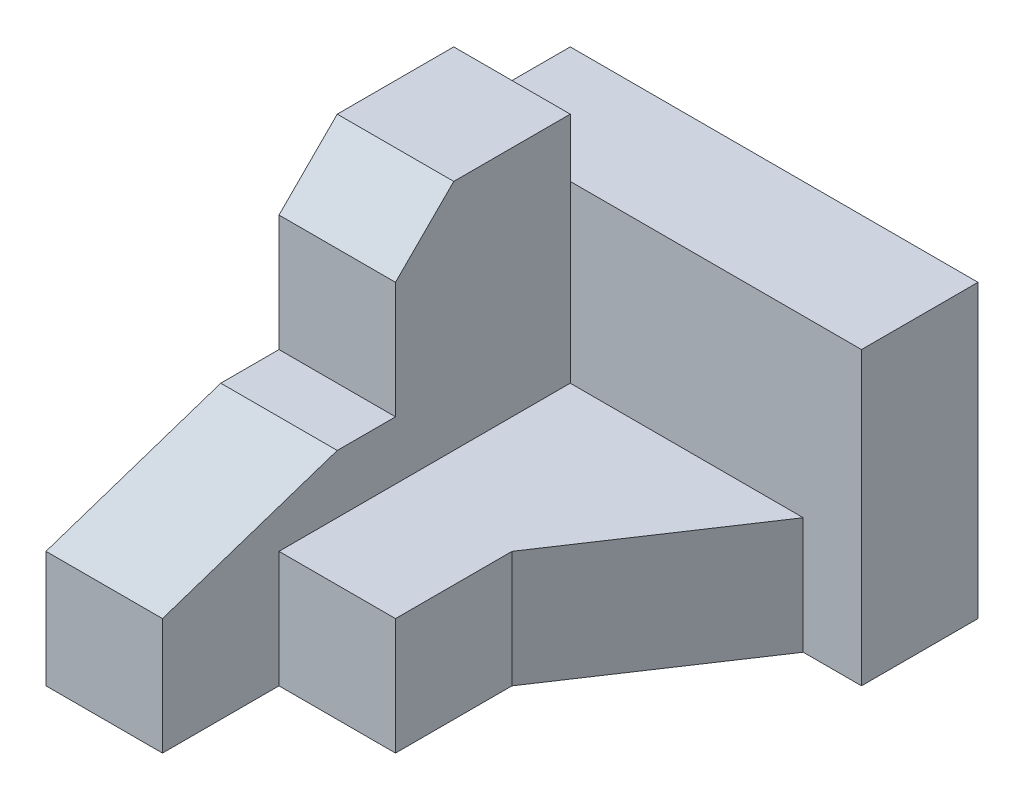
ISO-10303-21;
HEADER;
FILE_DESCRIPTION(('STEP AP214'),'2;1');
FILE_NAME('part.step','',(''),(''),'','','');
FILE_SCHEMA(('AUTOMOTIVE_DESIGN { 1 0 10303 214 1 1 1 1 }'));
ENDSEC;
DATA;
#1=APPLICATION_CONTEXT('core data for automotive mechanical design processes');
#2=APPLICATION_PROTOCOL_DEFINITION('international standard','automotive_design',2000,#1);
#3=PRODUCT_CONTEXT('',#1,'mechanical');
#4=PRODUCT('Part','Part','',(#3));
#5=PRODUCT_RELATED_PRODUCT_CATEGORY('part','',(#4));
#6=PRODUCT_DEFINITION_FORMATION('','',#4);
#7=PRODUCT_DEFINITION_CONTEXT('part definition',#1,'design');
#8=PRODUCT_DEFINITION('design','',#6,#7);
#9=PRODUCT_DEFINITION_SHAPE('','',#8);
#10=(LENGTH_UNIT() NAMED_UNIT(*) SI_UNIT(.MILLI.,.METRE.));
#11=(NAMED_UNIT(*) PLANE_ANGLE_UNIT() SI_UNIT($,.RADIAN.));
#12=(NAMED_UNIT(*) SI_UNIT($,.STERADIAN.) SOLID_ANGLE_UNIT());
#13=UNCERTAINTY_MEASURE_WITH_UNIT(LENGTH_MEASURE(1.E-05),#10,'distance_accuracy_value','');
#14=(GEOMETRIC_REPRESENTATION_CONTEXT(3) GLOBAL_UNCERTAINTY_ASSIGNED_CONTEXT((#13)) GLOBAL_UNIT_ASSIGNED_CONTEXT((#10,
#11,#12)) REPRESENTATION_CONTEXT('',''));
#15=CARTESIAN_POINT('',(0.,0.,0.));
#16=DIRECTION('',(0.,0.,1.));
#17=DIRECTION('',(1.,0.,0.));
#18=AXIS2_PLACEMENT_3D('',#15,#16,#17);
#19=CARTESIAN_POINT('',(0.,2.,-9.));
#20=DIRECTION('',(1.,0.,0.));
#21=DIRECTION('',(0.,0.,-1.));
#22=AXIS2_PLACEMENT_3D('',#19,#20,#21);
#23=PLANE('',#22);
#24=DIRECTION('',(0.,-0.316227766016838,0.948683298050514));
#25=VECTOR('',#24,1.);
#26=CARTESIAN_POINT('',(0.,4.7,-8.1));
#27=LINE('',#26,#25);
#28=CARTESIAN_POINT('',(-2.5E-06,3.,-3.));
#29=VERTEX_POINT('',#28);
#30=CARTESIAN_POINT('',(0.,2.,0.));
#31=VERTEX_POINT('',#30);
#32=EDGE_CURVE('E157',#29,#31,#27,.T.);
#33=ORIENTED_EDGE('',*,*,#32,.F.);
#34=DIRECTION('',(0.,0.,1.));
#35=VECTOR('',#34,1.);
#36=CARTESIAN_POINT('',(0.,3.,-9.));
#37=LINE('',#36,#35);
#38=CARTESIAN_POINT('',(0.,3.,-4.));
#39=VERTEX_POINT('',#38);
#40=EDGE_CURVE('E301',#39,#29,#37,.T.);
#41=ORIENTED_EDGE('',*,*,#40,.F.);
#42=DIRECTION('',(0.,-1.,0.));
#43=VECTOR('',#42,1.);
#44=CARTESIAN_POINT('',(0.,2.,-4.));
#45=LINE('',#44,#43);
#46=CARTESIAN_POINT('',(-2.50000000000684E-05,5.,-4.));
#47=VERTEX_POINT('',#46);
#48=EDGE_CURVE('E310',#47,#39,#45,.T.);
#49=ORIENTED_EDGE('',*,*,#48,.F.);
#50=DIRECTION('',(0.,-0.707106781186548,0.707106781186548));
#51=VECTOR('',#50,1.);
#52=CARTESIAN_POINT('',(0.,6.,-5.));
#53=LINE('',#52,#51);
#54=CARTESIAN_POINT('',(0.,6.,-5.));
#55=VERTEX_POINT('',#54);
#56=EDGE_CURVE('E300',#55,#47,#53,.T.);
#57=ORIENTED_EDGE('',*,*,#56,.F.);
#58=DIRECTION('',(0.,0.,1.));
#59=VECTOR('',#58,1.);
#60=CARTESIAN_POINT('',(0.,6.,-7.));
#61=LINE('',#60,#59);
#62=CARTESIAN_POINT('',(0.,6.,-7.));
#63=VERTEX_POINT('',#62);
#64=EDGE_CURVE('E321',#63,#55,#61,.T.);
#65=ORIENTED_EDGE('',*,*,#64,.F.);
#66=DIRECTION('',(0.,-1.,0.));
#67=VECTOR('',#66,1.);
#68=CARTESIAN_POINT('',(0.,6.,-7.));
#69=LINE('',#68,#67);
#70=CARTESIAN_POINT('',(0.,5.,-7.));
#71=VERTEX_POINT('',#70);
#72=EDGE_CURVE('E289',#63,#71,#69,.T.);
#73=ORIENTED_EDGE('',*,*,#72,.T.);
#74=DIRECTION('',(0.,0.,1.));
#75=VECTOR('',#74,1.);
#76=CARTESIAN_POINT('',(0.,5.,-9.));
#77=LINE('',#76,#75);
#78=CARTESIAN_POINT('',(0.,5.,-9.));
#79=VERTEX_POINT('',#78);
#80=EDGE_CURVE('E240',#79,#71,#77,.T.);
#81=ORIENTED_EDGE('',*,*,#80,.F.);
#82=DIRECTION('',(0.,-1.,0.));
#83=VECTOR('',#82,1.);
#84=CARTESIAN_POINT('',(0.,2.,-9.));
#85=LINE('',#84,#83);
#86=CARTESIAN_POINT('',(0.,0.,-9.));
#87=VERTEX_POINT('',#86);
#88=EDGE_CURVE('E217',#79,#87,#85,.T.);
#89=ORIENTED_EDGE('',*,*,#88,.T.);
#90=DIRECTION('',(0.,0.,1.));
#91=VECTOR('',#90,1.);
#92=CARTESIAN_POINT('',(0.,0.,-9.));
#93=LINE('',#92,#91);
#94=CARTESIAN_POINT('',(0.,0.,0.));
#95=VERTEX_POINT('',#94);
#96=EDGE_CURVE('E200',#87,#95,#93,.T.);
#97=ORIENTED_EDGE('',*,*,#96,.T.);
#98=DIRECTION('',(0.,-1.,0.));
#99=VECTOR('',#98,1.);
#100=CARTESIAN_POINT('',(0.,2.,0.));
#101=LINE('',#100,#99);
#102=EDGE_CURVE('E174',#31,#95,#101,.T.);
#103=ORIENTED_EDGE('',*,*,#102,.F.);
#104=EDGE_LOOP('',(#33,#41,#49,#57,#65,#73,#81,#89,#97,#103));
#105=FACE_BOUND('',#104,.T.);
#106=ADVANCED_FACE('F33',(#105),#23,.F.);
#107=CARTESIAN_POINT('',(2.,2.,0.));
#108=DIRECTION('',(-1.,0.,0.));
#109=DIRECTION('',(0.,0.,1.));
#110=AXIS2_PLACEMENT_3D('',#107,#108,#109);
#111=PLANE('',#110);
#112=DIRECTION('',(0.,-0.316227766016838,0.948683298050514));
#113=VECTOR('',#112,1.);
#114=CARTESIAN_POINT('',(2.,1.8,0.6));
#115=LINE('',#114,#113);
#116=CARTESIAN_POINT('',(2.,3.,-3.));
#117=VERTEX_POINT('',#116);
#118=CARTESIAN_POINT('',(2.,2.,0.));
#119=VERTEX_POINT('',#118);
#120=EDGE_CURVE('E154',#117,#119,#115,.T.);
#121=ORIENTED_EDGE('',*,*,#120,.T.);
#122=DIRECTION('',(0.,-1.,0.));
#123=VECTOR('',#122,1.);
#124=CARTESIAN_POINT('',(2.,2.,0.));
#125=LINE('',#124,#123);
#126=CARTESIAN_POINT('',(2.,0.,0.));
#127=VERTEX_POINT('',#126);
#128=EDGE_CURVE('E163',#119,#127,#125,.T.);
#129=ORIENTED_EDGE('',*,*,#128,.T.);
#130=DIRECTION('',(0.,0.,-1.));
#131=VECTOR('',#130,1.);
#132=CARTESIAN_POINT('',(2.,0.,0.));
#133=LINE('',#132,#131);
#134=CARTESIAN_POINT('',(2.,0.,-2.));
#135=VERTEX_POINT('',#134);
#136=EDGE_CURVE('E204',#127,#135,#133,.T.);
#137=ORIENTED_EDGE('',*,*,#136,.T.);
#138=DIRECTION('',(0.,-1.,0.));
#139=VECTOR('',#138,1.);
#140=CARTESIAN_POINT('',(2.,2.,-2.));
#141=LINE('',#140,#139);
#142=CARTESIAN_POINT('',(2.,2.,-2.));
#143=VERTEX_POINT('',#142);
#144=EDGE_CURVE('E175',#143,#135,#141,.T.);
#145=ORIENTED_EDGE('',*,*,#144,.F.);
#146=DIRECTION('',(0.,0.,-1.));
#147=VECTOR('',#146,1.);
#148=CARTESIAN_POINT('',(2.,2.,0.));
#149=LINE('',#148,#147);
#150=CARTESIAN_POINT('',(2.,2.,-7.));
#151=VERTEX_POINT('',#150);
#152=EDGE_CURVE('E101',#143,#151,#149,.T.);
#153=ORIENTED_EDGE('',*,*,#152,.T.);
#154=DIRECTION('',(0.,-1.,0.));
#155=VECTOR('',#154,1.);
#156=CARTESIAN_POINT('',(2.,5.,-7.));
#157=LINE('',#156,#155);
#158=CARTESIAN_POINT('',(2.,5.,-7.));
#159=VERTEX_POINT('',#158);
#160=EDGE_CURVE('E195',#159,#151,#157,.T.);
#161=ORIENTED_EDGE('',*,*,#160,.F.);
#162=DIRECTION('',(0.,-1.,0.));
#163=VECTOR('',#162,1.);
#164=CARTESIAN_POINT('',(2.,6.,-7.));
#165=LINE('',#164,#163);
#166=CARTESIAN_POINT('',(2.,6.,-7.));
#167=VERTEX_POINT('',#166);
#168=EDGE_CURVE('E194',#167,#159,#165,.T.);
#169=ORIENTED_EDGE('',*,*,#168,.F.);
#170=DIRECTION('',(0.,0.,-1.));
#171=VECTOR('',#170,1.);
#172=CARTESIAN_POINT('',(2.,6.,-7.));
#173=LINE('',#172,#171);
#174=CARTESIAN_POINT('',(2.,6.,-5.));
#175=VERTEX_POINT('',#174);
#176=EDGE_CURVE('E296',#175,#167,#173,.T.);
#177=ORIENTED_EDGE('',*,*,#176,.F.);
#178=DIRECTION('',(0.,-0.707106781186548,0.707106781186548));
#179=VECTOR('',#178,1.);
#180=CARTESIAN_POINT('',(2.,0.5,0.5));
#181=LINE('',#180,#179);
#182=CARTESIAN_POINT('',(2.,5.,-4.));
#183=VERTEX_POINT('',#182);
#184=EDGE_CURVE('E49',#175,#183,#181,.T.);
#185=ORIENTED_EDGE('',*,*,#184,.T.);
#186=DIRECTION('',(0.,-1.,0.));
#187=VECTOR('',#186,1.);
#188=CARTESIAN_POINT('',(2.,0.,-4.));
#189=LINE('',#188,#187);
#190=CARTESIAN_POINT('',(2.,3.,-4.));
#191=VERTEX_POINT('',#190);
#192=EDGE_CURVE('E345',#183,#191,#189,.T.);
#193=ORIENTED_EDGE('',*,*,#192,.T.);
#194=DIRECTION('',(0.,0.,1.));
#195=VECTOR('',#194,1.);
#196=CARTESIAN_POINT('',(2.,3.,0.));
#197=LINE('',#196,#195);
#198=EDGE_CURVE('E167',#191,#117,#197,.T.);
#199=ORIENTED_EDGE('',*,*,#198,.T.);
#200=EDGE_LOOP('',(#121,#129,#137,#145,#153,#161,#169,#177,#185,#193,#199));
#201=FACE_BOUND('',#200,.T.);
#202=ADVANCED_FACE('F162',(#201),#111,.F.);
#203=CARTESIAN_POINT('',(0.,2.,0.));
#204=DIRECTION('',(0.,0.,-1.));
#205=DIRECTION('',(-1.,0.,0.));
#206=AXIS2_PLACEMENT_3D('',#203,#204,#205);
#207=PLANE('',#206);
#208=DIRECTION('',(1.,0.,0.));
#209=VECTOR('',#208,1.);
#210=CARTESIAN_POINT('',(0.,2.,0.));
#211=LINE('',#210,#209);
#212=EDGE_CURVE('E11',#31,#119,#211,.T.);
#213=ORIENTED_EDGE('',*,*,#212,.F.);
#214=ORIENTED_EDGE('',*,*,#102,.T.);
#215=DIRECTION('',(1.,0.,0.));
#216=VECTOR('',#215,1.);
#217=CARTESIAN_POINT('',(0.,0.,0.));
#218=LINE('',#217,#216);
#219=EDGE_CURVE('E172',#95,#127,#218,.T.);
#220=ORIENTED_EDGE('',*,*,#219,.T.);
#221=ORIENTED_EDGE('',*,*,#128,.F.);
#222=EDGE_LOOP('',(#213,#214,#220,#221));
#223=FACE_BOUND('',#222,.T.);
#224=ADVANCED_FACE('F170',(#223),#207,.F.);
#225=CARTESIAN_POINT('',(0.,6.,0.));
#226=DIRECTION('',(0.,-1.,0.));
#227=DIRECTION('',(0.,0.,-1.));
#228=AXIS2_PLACEMENT_3D('',#225,#226,#227);
#229=PLANE('',#228);
#230=DIRECTION('',(-1.,0.,0.));
#231=VECTOR('',#230,1.);
#232=CARTESIAN_POINT('',(0.,6.,-5.));
#233=LINE('',#232,#231);
#234=EDGE_CURVE('E41',#175,#55,#233,.T.);
#235=ORIENTED_EDGE('',*,*,#234,.F.);
#236=ORIENTED_EDGE('',*,*,#176,.T.);
#237=DIRECTION('',(-1.,0.,0.));
#238=VECTOR('',#237,1.);
#239=CARTESIAN_POINT('',(2.,6.,-7.));
#240=LINE('',#239,#238);
#241=EDGE_CURVE('E320',#167,#63,#240,.T.);
#242=ORIENTED_EDGE('',*,*,#241,.T.);
#243=ORIENTED_EDGE('',*,*,#64,.T.);
#244=EDGE_LOOP('',(#235,#236,#242,#243));
#245=FACE_BOUND('',#244,.T.);
#246=ADVANCED_FACE('F351',(#245),#229,.F.);
#247=CARTESIAN_POINT('',(2.,2.,-2.));
#248=DIRECTION('',(0.,0.,-1.));
#249=DIRECTION('',(-1.,0.,0.));
#250=AXIS2_PLACEMENT_3D('',#247,#248,#249);
#251=PLANE('',#250);
#252=DIRECTION('',(1.,0.,0.));
#253=VECTOR('',#252,1.);
#254=CARTESIAN_POINT('',(2.,0.,-2.));
#255=LINE('',#254,#253);
#256=CARTESIAN_POINT('',(4.,0.,-2.));
#257=VERTEX_POINT('',#256);
#258=EDGE_CURVE('E206',#135,#257,#255,.T.);
#259=ORIENTED_EDGE('',*,*,#258,.T.);
#260=DIRECTION('',(0.,-1.,0.));
#261=VECTOR('',#260,1.);
#262=CARTESIAN_POINT('',(4.,2.,-2.));
#263=LINE('',#262,#261);
#264=CARTESIAN_POINT('',(4.,2.,-2.));
#265=VERTEX_POINT('',#264);
#266=EDGE_CURVE('E179',#265,#257,#263,.T.);
#267=ORIENTED_EDGE('',*,*,#266,.F.);
#268=DIRECTION('',(1.,0.,0.));
#269=VECTOR('',#268,1.);
#270=CARTESIAN_POINT('',(2.,2.,-2.));
#271=LINE('',#270,#269);
#272=EDGE_CURVE('E199',#143,#265,#271,.T.);
#273=ORIENTED_EDGE('',*,*,#272,.F.);
#274=ORIENTED_EDGE('',*,*,#144,.T.);
#275=EDGE_LOOP('',(#259,#267,#273,#274));
#276=FACE_BOUND('',#275,.T.);
#277=ADVANCED_FACE('F273',(#276),#251,.F.);
#278=CARTESIAN_POINT('',(4.,2.,-2.));
#279=DIRECTION('',(-1.,0.,0.));
#280=DIRECTION('',(0.,0.,1.));
#281=AXIS2_PLACEMENT_3D('',#278,#279,#280);
#282=PLANE('',#281);
#283=DIRECTION('',(0.,0.,-1.));
#284=VECTOR('',#283,1.);
#285=CARTESIAN_POINT('',(4.,0.,-2.));
#286=LINE('',#285,#284);
#287=CARTESIAN_POINT('',(4.,0.,-4.));
#288=VERTEX_POINT('',#287);
#289=EDGE_CURVE('E208',#257,#288,#286,.T.);
#290=ORIENTED_EDGE('',*,*,#289,.T.);
#291=DIRECTION('',(0.,-1.,0.));
#292=VECTOR('',#291,1.);
#293=CARTESIAN_POINT('',(4.,2.,-4.));
#294=LINE('',#293,#292);
#295=CARTESIAN_POINT('',(4.,2.,-4.));
#296=VERTEX_POINT('',#295);
#297=EDGE_CURVE('E224',#296,#288,#294,.T.);
#298=ORIENTED_EDGE('',*,*,#297,.F.);
#299=DIRECTION('',(0.,0.,-1.));
#300=VECTOR('',#299,1.);
#301=CARTESIAN_POINT('',(4.,2.,-2.));
#302=LINE('',#301,#300);
#303=EDGE_CURVE('E197',#265,#296,#302,.T.);
#304=ORIENTED_EDGE('',*,*,#303,.F.);
#305=ORIENTED_EDGE('',*,*,#266,.T.);
#306=EDGE_LOOP('',(#290,#298,#304,#305));
#307=FACE_BOUND('',#306,.T.);
#308=ADVANCED_FACE('F277',(#307),#282,.F.);
#309=CARTESIAN_POINT('',(4.,2.,-4.));
#310=DIRECTION('',(-0.832050294337844,0.,-0.554700196225229));
#311=DIRECTION('',(-0.554700196225229,0.,0.832050294337844));
#312=AXIS2_PLACEMENT_3D('',#309,#310,#311);
#313=PLANE('',#312);
#314=DIRECTION('',(0.554700196225229,0.,-0.832050294337844));
#315=VECTOR('',#314,1.);
#316=CARTESIAN_POINT('',(4.,0.,-4.));
#317=LINE('',#316,#315);
#318=CARTESIAN_POINT('',(6.,0.,-7.));
#319=VERTEX_POINT('',#318);
#320=EDGE_CURVE('E210',#288,#319,#317,.T.);
#321=ORIENTED_EDGE('',*,*,#320,.T.);
#322=DIRECTION('',(0.,-1.,0.));
#323=VECTOR('',#322,1.);
#324=CARTESIAN_POINT('',(6.,2.,-7.));
#325=LINE('',#324,#323);
#326=CARTESIAN_POINT('',(6.,2.,-7.));
#327=VERTEX_POINT('',#326);
#328=EDGE_CURVE('E223',#327,#319,#325,.T.);
#329=ORIENTED_EDGE('',*,*,#328,.F.);
#330=DIRECTION('',(0.554700196225229,0.,-0.832050294337844));
#331=VECTOR('',#330,1.);
#332=CARTESIAN_POINT('',(4.,2.,-4.));
#333=LINE('',#332,#331);
#334=EDGE_CURVE('E58',#296,#327,#333,.T.);
#335=ORIENTED_EDGE('',*,*,#334,.F.);
#336=ORIENTED_EDGE('',*,*,#297,.T.);
#337=EDGE_LOOP('',(#321,#329,#335,#336));
#338=FACE_BOUND('',#337,.T.);
#339=ADVANCED_FACE('F278',(#338),#313,.F.);
#340=CARTESIAN_POINT('',(6.,2.,-7.));
#341=DIRECTION('',(0.,0.,-1.));
#342=DIRECTION('',(-1.,0.,0.));
#343=AXIS2_PLACEMENT_3D('',#340,#341,#342);
#344=PLANE('',#343);
#345=DIRECTION('',(1.,0.,0.));
#346=VECTOR('',#345,1.);
#347=CARTESIAN_POINT('',(6.,0.,-7.));
#348=LINE('',#347,#346);
#349=CARTESIAN_POINT('',(7.,0.,-7.));
#350=VERTEX_POINT('',#349);
#351=EDGE_CURVE('E212',#319,#350,#348,.T.);
#352=ORIENTED_EDGE('',*,*,#351,.T.);
#353=DIRECTION('',(0.,-1.,0.));
#354=VECTOR('',#353,1.);
#355=CARTESIAN_POINT('',(7.,2.,-7.));
#356=LINE('',#355,#354);
#357=CARTESIAN_POINT('',(7.,5.,-7.));
#358=VERTEX_POINT('',#357);
#359=EDGE_CURVE('E221',#358,#350,#356,.T.);
#360=ORIENTED_EDGE('',*,*,#359,.F.);
#361=DIRECTION('',(1.,0.,0.));
#362=VECTOR('',#361,1.);
#363=CARTESIAN_POINT('',(2.,5.,-7.));
#364=LINE('',#363,#362);
#365=EDGE_CURVE('E243',#159,#358,#364,.T.);
#366=ORIENTED_EDGE('',*,*,#365,.F.);
#367=ORIENTED_EDGE('',*,*,#160,.T.);
#368=DIRECTION('',(1.,0.,0.));
#369=VECTOR('',#368,1.);
#370=CARTESIAN_POINT('',(2.,2.,-7.));
#371=LINE('',#370,#369);
#372=EDGE_CURVE('E189',#151,#327,#371,.T.);
#373=ORIENTED_EDGE('',*,*,#372,.T.);
#374=ORIENTED_EDGE('',*,*,#328,.T.);
#375=EDGE_LOOP('',(#352,#360,#366,#367,#373,#374));
#376=FACE_BOUND('',#375,.T.);
#377=ADVANCED_FACE('F258',(#376),#344,.F.);
#378=CARTESIAN_POINT('',(7.,2.,-7.));
#379=DIRECTION('',(-1.,0.,0.));
#380=DIRECTION('',(0.,0.,1.));
#381=AXIS2_PLACEMENT_3D('',#378,#379,#380);
#382=PLANE('',#381);
#383=DIRECTION('',(0.,0.,-1.));
#384=VECTOR('',#383,1.);
#385=CARTESIAN_POINT('',(7.,0.,-7.));
#386=LINE('',#385,#384);
#387=CARTESIAN_POINT('',(7.,0.,-9.));
#388=VERTEX_POINT('',#387);
#389=EDGE_CURVE('E214',#350,#388,#386,.T.);
#390=ORIENTED_EDGE('',*,*,#389,.T.);
#391=DIRECTION('',(0.,-1.,0.));
#392=VECTOR('',#391,1.);
#393=CARTESIAN_POINT('',(7.,2.,-9.));
#394=LINE('',#393,#392);
#395=CARTESIAN_POINT('',(7.,5.,-9.));
#396=VERTEX_POINT('',#395);
#397=EDGE_CURVE('E219',#396,#388,#394,.T.);
#398=ORIENTED_EDGE('',*,*,#397,.F.);
#399=DIRECTION('',(0.,0.,-1.));
#400=VECTOR('',#399,1.);
#401=CARTESIAN_POINT('',(7.,5.,-7.));
#402=LINE('',#401,#400);
#403=EDGE_CURVE('E193',#358,#396,#402,.T.);
#404=ORIENTED_EDGE('',*,*,#403,.F.);
#405=ORIENTED_EDGE('',*,*,#359,.T.);
#406=EDGE_LOOP('',(#390,#398,#404,#405));
#407=FACE_BOUND('',#406,.T.);
#408=ADVANCED_FACE('F284',(#407),#382,.F.);
#409=CARTESIAN_POINT('',(7.,2.,-9.));
#410=DIRECTION('',(0.,0.,1.));
#411=DIRECTION('',(1.,0.,0.));
#412=AXIS2_PLACEMENT_3D('',#409,#410,#411);
#413=PLANE('',#412);
#414=DIRECTION('',(-1.,0.,0.));
#415=VECTOR('',#414,1.);
#416=CARTESIAN_POINT('',(7.,0.,-9.));
#417=LINE('',#416,#415);
#418=EDGE_CURVE('E95',#388,#87,#417,.T.);
#419=ORIENTED_EDGE('',*,*,#418,.T.);
#420=ORIENTED_EDGE('',*,*,#88,.F.);
#421=DIRECTION('',(-1.,0.,0.));
#422=VECTOR('',#421,1.);
#423=CARTESIAN_POINT('',(7.,5.,-9.));
#424=LINE('',#423,#422);
#425=EDGE_CURVE('E244',#396,#79,#424,.T.);
#426=ORIENTED_EDGE('',*,*,#425,.F.);
#427=ORIENTED_EDGE('',*,*,#397,.T.);
#428=EDGE_LOOP('',(#419,#420,#426,#427));
#429=FACE_BOUND('',#428,.T.);
#430=ADVANCED_FACE('F335',(#429),#413,.F.);
#431=CARTESIAN_POINT('',(0.,2.,0.));
#432=DIRECTION('',(0.,1.,0.));
#433=DIRECTION('',(0.,0.,1.));
#434=AXIS2_PLACEMENT_3D('',#431,#432,#433);
#435=PLANE('',#434);
#436=ORIENTED_EDGE('',*,*,#372,.F.);
#437=ORIENTED_EDGE('',*,*,#152,.F.);
#438=ORIENTED_EDGE('',*,*,#272,.T.);
#439=ORIENTED_EDGE('',*,*,#303,.T.);
#440=ORIENTED_EDGE('',*,*,#334,.T.);
#441=EDGE_LOOP('',(#436,#437,#438,#439,#440));
#442=FACE_BOUND('',#441,.T.);
#443=ADVANCED_FACE('F270',(#442),#435,.T.);
#444=CARTESIAN_POINT('',(0.,0.,0.));
#445=DIRECTION('',(0.,1.,0.));
#446=DIRECTION('',(0.,0.,1.));
#447=AXIS2_PLACEMENT_3D('',#444,#445,#446);
#448=PLANE('',#447);
#449=ORIENTED_EDGE('',*,*,#96,.F.);
#450=ORIENTED_EDGE('',*,*,#418,.F.);
#451=ORIENTED_EDGE('',*,*,#389,.F.);
#452=ORIENTED_EDGE('',*,*,#351,.F.);
#453=ORIENTED_EDGE('',*,*,#320,.F.);
#454=ORIENTED_EDGE('',*,*,#289,.F.);
#455=ORIENTED_EDGE('',*,*,#258,.F.);
#456=ORIENTED_EDGE('',*,*,#136,.F.);
#457=ORIENTED_EDGE('',*,*,#219,.F.);
#458=EDGE_LOOP('',(#449,#450,#451,#452,#453,#454,#455,#456,#457));
#459=FACE_BOUND('',#458,.T.);
#460=ADVANCED_FACE('F281',(#459),#448,.F.);
#461=CARTESIAN_POINT('',(0.,5.,0.));
#462=DIRECTION('',(0.,1.,0.));
#463=DIRECTION('',(0.,0.,1.));
#464=AXIS2_PLACEMENT_3D('',#461,#462,#463);
#465=PLANE('',#464);
#466=DIRECTION('',(-1.,0.,0.));
#467=VECTOR('',#466,1.);
#468=CARTESIAN_POINT('',(2.,5.,-7.));
#469=LINE('',#468,#467);
#470=EDGE_CURVE('E245',#159,#71,#469,.T.);
#471=ORIENTED_EDGE('',*,*,#470,.F.);
#472=ORIENTED_EDGE('',*,*,#365,.T.);
#473=ORIENTED_EDGE('',*,*,#403,.T.);
#474=ORIENTED_EDGE('',*,*,#425,.T.);
#475=ORIENTED_EDGE('',*,*,#80,.T.);
#476=EDGE_LOOP('',(#471,#472,#473,#474,#475));
#477=FACE_BOUND('',#476,.T.);
#478=ADVANCED_FACE('F334',(#477),#465,.T.);
#479=CARTESIAN_POINT('',(2.,6.,-7.));
#480=DIRECTION('',(0.,0.,1.));
#481=DIRECTION('',(1.,0.,0.));
#482=AXIS2_PLACEMENT_3D('',#479,#480,#481);
#483=PLANE('',#482);
#484=ORIENTED_EDGE('',*,*,#470,.T.);
#485=ORIENTED_EDGE('',*,*,#72,.F.);
#486=ORIENTED_EDGE('',*,*,#241,.F.);
#487=ORIENTED_EDGE('',*,*,#168,.T.);
#488=EDGE_LOOP('',(#484,#485,#486,#487));
#489=FACE_BOUND('',#488,.T.);
#490=ADVANCED_FACE('F333',(#489),#483,.F.);
#491=CARTESIAN_POINT('',(-5.00000000001367E-05,0.5,0.5));
#492=DIRECTION('',(0.,0.707106781186547,0.707106781186547));
#493=DIRECTION('',(0.,-0.707106781186548,0.707106781186548));
#494=AXIS2_PLACEMENT_3D('',#491,#492,#493);
#495=PLANE('',#494);
#496=ORIENTED_EDGE('',*,*,#56,.T.);
#497=DIRECTION('',(1.,0.,0.));
#498=VECTOR('',#497,1.);
#499=CARTESIAN_POINT('',(2.,5.,-4.));
#500=LINE('',#499,#498);
#501=EDGE_CURVE('E294',#47,#183,#500,.T.);
#502=ORIENTED_EDGE('',*,*,#501,.T.);
#503=ORIENTED_EDGE('',*,*,#184,.F.);
#504=ORIENTED_EDGE('',*,*,#234,.T.);
#505=EDGE_LOOP('',(#496,#502,#503,#504));
#506=FACE_BOUND('',#505,.T.);
#507=ADVANCED_FACE('F350',(#506),#495,.T.);
#508=CARTESIAN_POINT('',(-5.00000000001367E-05,3.,0.));
#509=DIRECTION('',(0.,1.,0.));
#510=DIRECTION('',(0.,0.,1.));
#511=AXIS2_PLACEMENT_3D('',#508,#509,#510);
#512=PLANE('',#511);
#513=ORIENTED_EDGE('',*,*,#40,.T.);
#514=DIRECTION('',(1.,0.,0.));
#515=VECTOR('',#514,1.);
#516=CARTESIAN_POINT('',(-5.00000000001367E-05,3.,-3.));
#517=LINE('',#516,#515);
#518=EDGE_CURVE('E168',#29,#117,#517,.T.);
#519=ORIENTED_EDGE('',*,*,#518,.T.);
#520=ORIENTED_EDGE('',*,*,#198,.F.);
#521=DIRECTION('',(1.,0.,0.));
#522=VECTOR('',#521,1.);
#523=CARTESIAN_POINT('',(-5.00000000001367E-05,3.,-4.));
#524=LINE('',#523,#522);
#525=EDGE_CURVE('E341',#39,#191,#524,.T.);
#526=ORIENTED_EDGE('',*,*,#525,.F.);
#527=EDGE_LOOP('',(#513,#519,#520,#526));
#528=FACE_BOUND('',#527,.T.);
#529=ADVANCED_FACE('F340',(#528),#512,.T.);
#530=CARTESIAN_POINT('',(-5.00000000001367E-05,1.8,0.6));
#531=DIRECTION('',(0.,0.948683298050514,0.316227766016838));
#532=DIRECTION('',(0.,-0.316227766016838,0.948683298050514));
#533=AXIS2_PLACEMENT_3D('',#530,#531,#532);
#534=PLANE('',#533);
#535=ORIENTED_EDGE('',*,*,#32,.T.);
#536=ORIENTED_EDGE('',*,*,#212,.T.);
#537=ORIENTED_EDGE('',*,*,#120,.F.);
#538=ORIENTED_EDGE('',*,*,#518,.F.);
#539=EDGE_LOOP('',(#535,#536,#537,#538));
#540=FACE_BOUND('',#539,.T.);
#541=ADVANCED_FACE('F153',(#540),#534,.T.);
#542=CARTESIAN_POINT('',(-5.00000000001367E-05,0.,-4.));
#543=DIRECTION('',(0.,0.,1.));
#544=DIRECTION('',(1.,0.,0.));
#545=AXIS2_PLACEMENT_3D('',#542,#543,#544);
#546=PLANE('',#545);
#547=ORIENTED_EDGE('',*,*,#48,.T.);
#548=ORIENTED_EDGE('',*,*,#525,.T.);
#549=ORIENTED_EDGE('',*,*,#192,.F.);
#550=ORIENTED_EDGE('',*,*,#501,.F.);
#551=EDGE_LOOP('',(#547,#548,#549,#550));
#552=FACE_BOUND('',#551,.T.);
#553=ADVANCED_FACE('F349',(#552),#546,.T.);
#554=CLOSED_SHELL('',(#106,#202,#224,#246,#277,#308,#339,#377,#408,#430,#443,#460,#478,#490,
#507,#529,#541,#553));
#555=MANIFOLD_SOLID_BREP('B2',#554);
#556=ADVANCED_BREP_SHAPE_REPRESENTATION('',(#18,#555),#14);
#557=SHAPE_DEFINITION_REPRESENTATION(#9,#556);
ENDSEC;
END-ISO-10303-21;
